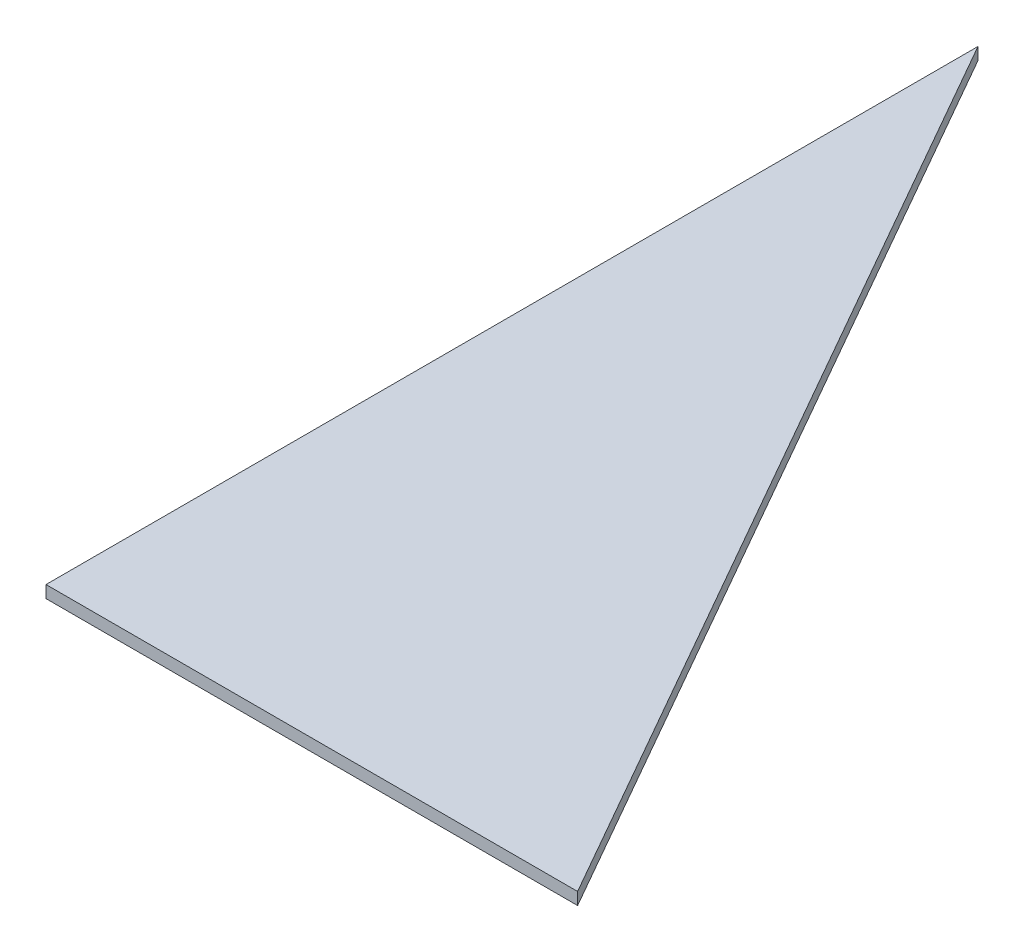
ISO-10303-21;
HEADER;
FILE_DESCRIPTION(('STEP AP214'),'2;1');
FILE_NAME('part.step','',(''),(''),'','','');
FILE_SCHEMA(('AUTOMOTIVE_DESIGN { 1 0 10303 214 1 1 1 1 }'));
ENDSEC;
DATA;
#1=APPLICATION_CONTEXT('core data for automotive mechanical design processes');
#2=APPLICATION_PROTOCOL_DEFINITION('international standard','automotive_design',2000,#1);
#3=PRODUCT_CONTEXT('',#1,'mechanical');
#4=PRODUCT('Part','Part','',(#3));
#5=PRODUCT_RELATED_PRODUCT_CATEGORY('part','',(#4));
#6=PRODUCT_DEFINITION_FORMATION('','',#4);
#7=PRODUCT_DEFINITION_CONTEXT('part definition',#1,'design');
#8=PRODUCT_DEFINITION('design','',#6,#7);
#9=PRODUCT_DEFINITION_SHAPE('','',#8);
#10=(LENGTH_UNIT() NAMED_UNIT(*) SI_UNIT(.MILLI.,.METRE.));
#11=(NAMED_UNIT(*) PLANE_ANGLE_UNIT() SI_UNIT($,.RADIAN.));
#12=(NAMED_UNIT(*) SI_UNIT($,.STERADIAN.) SOLID_ANGLE_UNIT());
#13=UNCERTAINTY_MEASURE_WITH_UNIT(LENGTH_MEASURE(1.E-05),#10,'distance_accuracy_value','');
#14=(GEOMETRIC_REPRESENTATION_CONTEXT(3) GLOBAL_UNCERTAINTY_ASSIGNED_CONTEXT((#13)) GLOBAL_UNIT_ASSIGNED_CONTEXT((#10,
#11,#12)) REPRESENTATION_CONTEXT('',''));
#15=CARTESIAN_POINT('',(0.,0.,0.));
#16=DIRECTION('',(0.,0.,1.));
#17=DIRECTION('',(1.,0.,0.));
#18=AXIS2_PLACEMENT_3D('',#15,#16,#17);
#19=CARTESIAN_POINT('',(0.,12.7,0.));
#20=DIRECTION('',(0.,1.,0.));
#21=DIRECTION('',(0.,0.,1.));
#22=AXIS2_PLACEMENT_3D('',#19,#20,#21);
#23=PLANE('',#22);
#24=DIRECTION('',(-0.495470488448794,0.,-0.868624772313289));
#25=VECTOR('',#24,1.);
#26=CARTESIAN_POINT('',(552.731021857818,12.7,969.01));
#27=LINE('',#26,#25);
#28=CARTESIAN_POINT('',(-5.77315972805081E-12,12.7,3.41393580072236E-12));
#29=VERTEX_POINT('',#28);
#30=CARTESIAN_POINT('',(552.731021857818,12.7,969.01));
#31=VERTEX_POINT('',#30);
#32=EDGE_CURVE('E60',#29,#31,#27,.F.);
#33=ORIENTED_EDGE('',*,*,#32,.F.);
#34=DIRECTION('',(0.,0.,1.));
#35=VECTOR('',#34,1.);
#36=CARTESIAN_POINT('',(0.,12.7,0.));
#37=LINE('',#36,#35);
#38=CARTESIAN_POINT('',(0.,12.7,969.01));
#39=VERTEX_POINT('',#38);
#40=EDGE_CURVE('E20',#39,#29,#37,.F.);
#41=ORIENTED_EDGE('',*,*,#40,.F.);
#42=DIRECTION('',(1.,0.,0.));
#43=VECTOR('',#42,1.);
#44=CARTESIAN_POINT('',(0.,12.7,969.01));
#45=LINE('',#44,#43);
#46=EDGE_CURVE('E53',#31,#39,#45,.F.);
#47=ORIENTED_EDGE('',*,*,#46,.F.);
#48=EDGE_LOOP('',(#33,#41,#47));
#49=FACE_BOUND('',#48,.T.);
#50=ADVANCED_FACE('F17',(#49),#23,.T.);
#51=CARTESIAN_POINT('',(0.,0.,0.));
#52=DIRECTION('',(-1.,0.,0.));
#53=DIRECTION('',(0.,0.,1.));
#54=AXIS2_PLACEMENT_3D('',#51,#52,#53);
#55=PLANE('',#54);
#56=DIRECTION('',(0.,1.,0.));
#57=VECTOR('',#56,1.);
#58=CARTESIAN_POINT('',(-2.32036612146658E-11,0.,1.33226762955019E-11));
#59=LINE('',#58,#57);
#60=CARTESIAN_POINT('',(-5.80091530366644E-12,0.,3.33066907387547E-12));
#61=VERTEX_POINT('',#60);
#62=EDGE_CURVE('E64',#61,#29,#59,.T.);
#63=ORIENTED_EDGE('',*,*,#62,.F.);
#64=DIRECTION('',(0.,0.,1.));
#65=VECTOR('',#64,1.);
#66=CARTESIAN_POINT('',(0.,0.,0.));
#67=LINE('',#66,#65);
#68=CARTESIAN_POINT('',(0.,0.,969.01));
#69=VERTEX_POINT('',#68);
#70=EDGE_CURVE('E63',#61,#69,#67,.T.);
#71=ORIENTED_EDGE('',*,*,#70,.T.);
#72=DIRECTION('',(0.,1.,0.));
#73=VECTOR('',#72,1.);
#74=CARTESIAN_POINT('',(0.,0.,969.01));
#75=LINE('',#74,#73);
#76=EDGE_CURVE('E56',#39,#69,#75,.F.);
#77=ORIENTED_EDGE('',*,*,#76,.F.);
#78=ORIENTED_EDGE('',*,*,#40,.T.);
#79=EDGE_LOOP('',(#63,#71,#77,#78));
#80=FACE_BOUND('',#79,.T.);
#81=ADVANCED_FACE('F62',(#80),#55,.T.);
#82=CARTESIAN_POINT('',(0.,0.,969.01));
#83=DIRECTION('',(0.,0.,1.));
#84=DIRECTION('',(1.,0.,0.));
#85=AXIS2_PLACEMENT_3D('',#82,#83,#84);
#86=PLANE('',#85);
#87=ORIENTED_EDGE('',*,*,#76,.T.);
#88=DIRECTION('',(1.,0.,0.));
#89=VECTOR('',#88,1.);
#90=CARTESIAN_POINT('',(0.,0.,969.01));
#91=LINE('',#90,#89);
#92=CARTESIAN_POINT('',(552.731021857818,0.,969.01));
#93=VERTEX_POINT('',#92);
#94=EDGE_CURVE('E26',#69,#93,#91,.T.);
#95=ORIENTED_EDGE('',*,*,#94,.T.);
#96=DIRECTION('',(0.,1.,0.));
#97=VECTOR('',#96,1.);
#98=CARTESIAN_POINT('',(552.731021857818,0.,969.01));
#99=LINE('',#98,#97);
#100=EDGE_CURVE('E34',#31,#93,#99,.F.);
#101=ORIENTED_EDGE('',*,*,#100,.F.);
#102=ORIENTED_EDGE('',*,*,#46,.T.);
#103=EDGE_LOOP('',(#87,#95,#101,#102));
#104=FACE_BOUND('',#103,.T.);
#105=ADVANCED_FACE('F54',(#104),#86,.T.);
#106=CARTESIAN_POINT('',(552.731021857818,0.,969.01));
#107=DIRECTION('',(0.868624772313289,0.,-0.495470488448794));
#108=DIRECTION('',(-0.495470488448794,0.,-0.868624772313289));
#109=AXIS2_PLACEMENT_3D('',#106,#107,#108);
#110=PLANE('',#109);
#111=ORIENTED_EDGE('',*,*,#100,.T.);
#112=DIRECTION('',(-0.495470488448773,0.,-0.868624772313301));
#113=VECTOR('',#112,1.);
#114=CARTESIAN_POINT('',(552.731021857818,0.,969.01));
#115=LINE('',#114,#113);
#116=EDGE_CURVE('E11',#93,#61,#115,.T.);
#117=ORIENTED_EDGE('',*,*,#116,.T.);
#118=ORIENTED_EDGE('',*,*,#62,.T.);
#119=ORIENTED_EDGE('',*,*,#32,.T.);
#120=EDGE_LOOP('',(#111,#117,#118,#119));
#121=FACE_BOUND('',#120,.T.);
#122=ADVANCED_FACE('F73',(#121),#110,.T.);
#123=CARTESIAN_POINT('',(0.,0.,0.));
#124=DIRECTION('',(0.,1.,0.));
#125=DIRECTION('',(0.,0.,1.));
#126=AXIS2_PLACEMENT_3D('',#123,#124,#125);
#127=PLANE('',#126);
#128=ORIENTED_EDGE('',*,*,#94,.F.);
#129=ORIENTED_EDGE('',*,*,#70,.F.);
#130=ORIENTED_EDGE('',*,*,#116,.F.);
#131=EDGE_LOOP('',(#128,#129,#130));
#132=FACE_BOUND('',#131,.T.);
#133=ADVANCED_FACE('F72',(#132),#127,.F.);
#134=CLOSED_SHELL('',(#50,#81,#105,#122,#133));
#135=MANIFOLD_SOLID_BREP('B1',#134);
#136=ADVANCED_BREP_SHAPE_REPRESENTATION('',(#18,#135),#14);
#137=SHAPE_DEFINITION_REPRESENTATION(#9,#136);
ENDSEC;
END-ISO-10303-21;
